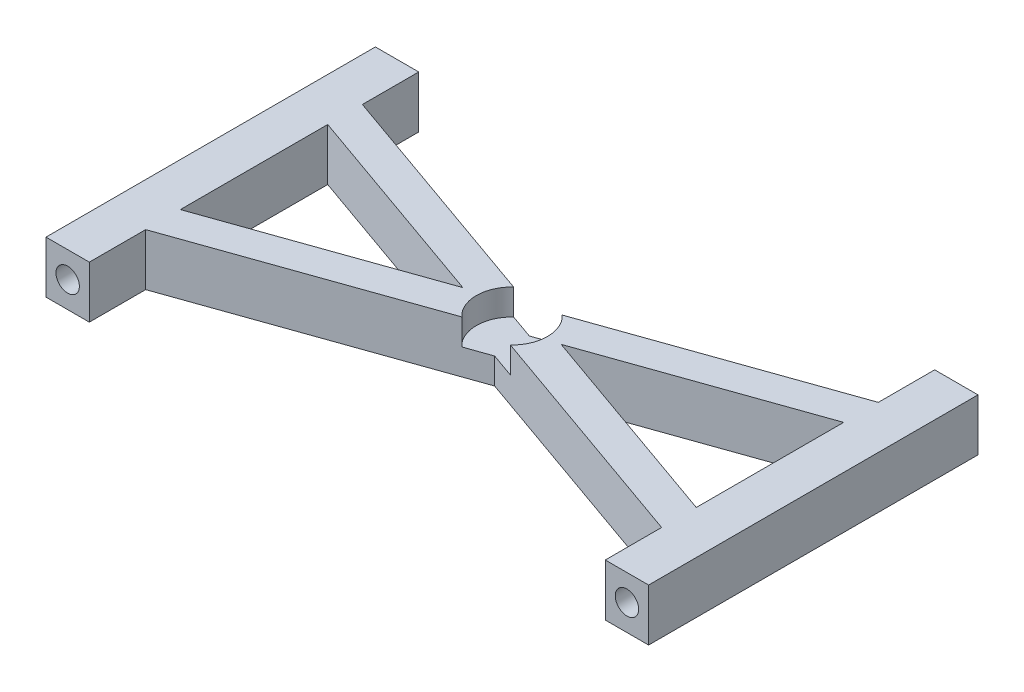
ISO-10303-21;
HEADER;
FILE_DESCRIPTION(('STEP AP214'),'2;1');
FILE_NAME('part.step','',(''),(''),'','','');
FILE_SCHEMA(('AUTOMOTIVE_DESIGN { 1 0 10303 214 1 1 1 1 }'));
ENDSEC;
DATA;
#1=APPLICATION_CONTEXT('core data for automotive mechanical design processes');
#2=APPLICATION_PROTOCOL_DEFINITION('international standard','automotive_design',2000,#1);
#3=PRODUCT_CONTEXT('',#1,'mechanical');
#4=PRODUCT('Part','Part','',(#3));
#5=PRODUCT_RELATED_PRODUCT_CATEGORY('part','',(#4));
#6=PRODUCT_DEFINITION_FORMATION('','',#4);
#7=PRODUCT_DEFINITION_CONTEXT('part definition',#1,'design');
#8=PRODUCT_DEFINITION('design','',#6,#7);
#9=PRODUCT_DEFINITION_SHAPE('','',#8);
#10=(LENGTH_UNIT() NAMED_UNIT(*) SI_UNIT(.MILLI.,.METRE.));
#11=(NAMED_UNIT(*) PLANE_ANGLE_UNIT() SI_UNIT($,.RADIAN.));
#12=(NAMED_UNIT(*) SI_UNIT($,.STERADIAN.) SOLID_ANGLE_UNIT());
#13=UNCERTAINTY_MEASURE_WITH_UNIT(LENGTH_MEASURE(1.E-05),#10,'distance_accuracy_value','');
#14=(GEOMETRIC_REPRESENTATION_CONTEXT(3) GLOBAL_UNCERTAINTY_ASSIGNED_CONTEXT((#13)) GLOBAL_UNIT_ASSIGNED_CONTEXT((#10,
#11,#12)) REPRESENTATION_CONTEXT('',''));
#15=CARTESIAN_POINT('',(0.,0.,0.));
#16=DIRECTION('',(0.,0.,1.));
#17=DIRECTION('',(1.,0.,0.));
#18=AXIS2_PLACEMENT_3D('',#15,#16,#17);
#19=CARTESIAN_POINT('',(0.,6.,0.));
#20=DIRECTION('',(0.,1.,0.));
#21=DIRECTION('',(0.,0.,1.));
#22=AXIS2_PLACEMENT_3D('',#19,#20,#21);
#23=PLANE('',#22);
#24=CARTESIAN_POINT('',(32.26,6.,-12.5));
#25=DIRECTION('',(0.,1.,0.));
#26=DIRECTION('',(0.,0.,1.));
#27=AXIS2_PLACEMENT_3D('',#24,#25,#26);
#28=CIRCLE('',#27,4.1);
#29=CARTESIAN_POINT('',(35.065500531111,6.,-9.51015606261203));
#30=VERTEX_POINT('',#29);
#31=CARTESIAN_POINT('',(35.065500531111,6.,-15.489843937388));
#32=VERTEX_POINT('',#31);
#33=EDGE_CURVE('E481',#30,#32,#28,.T.);
#34=ORIENTED_EDGE('',*,*,#33,.F.);
#35=DIRECTION('',(-0.943025428540768,0.,-0.332720665311763));
#36=VECTOR('',#35,1.);
#37=CARTESIAN_POINT('',(6.86580261060364,6.,-19.4596462563394));
#38=LINE('',#37,#36);
#39=CARTESIAN_POINT('',(62.02,6.,0.));
#40=VERTEX_POINT('',#39);
#41=EDGE_CURVE('E263',#40,#30,#38,.T.);
#42=ORIENTED_EDGE('',*,*,#41,.F.);
#43=DIRECTION('',(0.,0.,1.));
#44=VECTOR('',#43,1.);
#45=CARTESIAN_POINT('',(62.02,6.,0.));
#46=LINE('',#45,#44);
#47=CARTESIAN_POINT('',(62.02,6.,6.5));
#48=VERTEX_POINT('',#47);
#49=EDGE_CURVE('E451',#40,#48,#46,.T.);
#50=ORIENTED_EDGE('',*,*,#49,.T.);
#51=DIRECTION('',(-1.,0.,0.));
#52=VECTOR('',#51,1.);
#53=CARTESIAN_POINT('',(0.,6.,6.5));
#54=LINE('',#53,#52);
#55=CARTESIAN_POINT('',(67.02,6.,6.5));
#56=VERTEX_POINT('',#55);
#57=EDGE_CURVE('E448',#56,#48,#54,.T.);
#58=ORIENTED_EDGE('',*,*,#57,.F.);
#59=DIRECTION('',(0.,0.,1.));
#60=VECTOR('',#59,1.);
#61=CARTESIAN_POINT('',(67.02,6.,0.));
#62=LINE('',#61,#60);
#63=CARTESIAN_POINT('',(67.02,6.,-31.5));
#64=VERTEX_POINT('',#63);
#65=EDGE_CURVE('E445',#64,#56,#62,.T.);
#66=ORIENTED_EDGE('',*,*,#65,.F.);
#67=DIRECTION('',(-1.,0.,0.));
#68=VECTOR('',#67,1.);
#69=CARTESIAN_POINT('',(0.,6.,-31.5));
#70=LINE('',#69,#68);
#71=CARTESIAN_POINT('',(62.02,6.,-31.5));
#72=VERTEX_POINT('',#71);
#73=EDGE_CURVE('E443',#64,#72,#70,.T.);
#74=ORIENTED_EDGE('',*,*,#73,.T.);
#75=CARTESIAN_POINT('',(62.02,6.,-25.));
#76=VERTEX_POINT('',#75);
#77=EDGE_CURVE('E442',#72,#76,#46,.T.);
#78=ORIENTED_EDGE('',*,*,#77,.T.);
#79=DIRECTION('',(-0.943025428540768,0.,0.332720665311763));
#80=VECTOR('',#79,1.);
#81=CARTESIAN_POINT('',(-0.978298589146223,6.,-2.77277771552301));
#82=LINE('',#81,#80);
#83=EDGE_CURVE('E439',#76,#32,#82,.T.);
#84=ORIENTED_EDGE('',*,*,#83,.T.);
#85=EDGE_LOOP('',(#34,#42,#50,#58,#66,#74,#78,#84));
#86=FACE_BOUND('',#85,.T.);
#87=DIRECTION('',(0.,0.,1.));
#88=VECTOR('',#87,1.);
#89=CARTESIAN_POINT('',(62.02,6.,0.));
#90=LINE('',#89,#88);
#91=CARTESIAN_POINT('',(62.02,6.,-21.));
#92=VERTEX_POINT('',#91);
#93=CARTESIAN_POINT('',(62.02,6.,-3.99999999999999));
#94=VERTEX_POINT('',#93);
#95=EDGE_CURVE('E190',#92,#94,#90,.T.);
#96=ORIENTED_EDGE('',*,*,#95,.T.);
#97=DIRECTION('',(0.943025428540768,0.,0.332720665311763));
#98=VECTOR('',#97,1.);
#99=CARTESIAN_POINT('',(8.12085880256361,6.,-23.0168340918374));
#100=LINE('',#99,#98);
#101=CARTESIAN_POINT('',(37.9285714285714,6.,-12.5));
#102=VERTEX_POINT('',#101);
#103=EDGE_CURVE('E193',#102,#94,#100,.T.);
#104=ORIENTED_EDGE('',*,*,#103,.F.);
#105=DIRECTION('',(0.943025428540768,0.,-0.332720665311763));
#106=VECTOR('',#105,1.);
#107=CARTESIAN_POINT('',(0.276757602813755,6.,0.784410119974986));
#108=LINE('',#107,#106);
#109=EDGE_CURVE('E67',#102,#92,#108,.T.);
#110=ORIENTED_EDGE('',*,*,#109,.T.);
#111=EDGE_LOOP('',(#96,#104,#110));
#112=FACE_BOUND('',#111,.T.);
#113=ADVANCED_FACE('F43',(#86,#112),#23,.T.);
#114=CARTESIAN_POINT('',(62.02,6.,0.));
#115=DIRECTION('',(1.,0.,0.));
#116=DIRECTION('',(0.,0.,-1.));
#117=AXIS2_PLACEMENT_3D('',#114,#115,#116);
#118=PLANE('',#117);
#119=DIRECTION('',(0.,0.,1.));
#120=VECTOR('',#119,1.);
#121=CARTESIAN_POINT('',(62.02,0.,0.));
#122=LINE('',#121,#120);
#123=CARTESIAN_POINT('',(62.02,0.,-21.));
#124=VERTEX_POINT('',#123);
#125=CARTESIAN_POINT('',(62.02,0.,-3.99999999999999));
#126=VERTEX_POINT('',#125);
#127=EDGE_CURVE('E201',#124,#126,#122,.T.);
#128=ORIENTED_EDGE('',*,*,#127,.T.);
#129=DIRECTION('',(0.,-1.,0.));
#130=VECTOR('',#129,1.);
#131=CARTESIAN_POINT('',(62.02,6.,-3.99999999999999));
#132=LINE('',#131,#130);
#133=EDGE_CURVE('E198',#94,#126,#132,.T.);
#134=ORIENTED_EDGE('',*,*,#133,.F.);
#135=ORIENTED_EDGE('',*,*,#95,.F.);
#136=DIRECTION('',(0.,-1.,0.));
#137=VECTOR('',#136,1.);
#138=CARTESIAN_POINT('',(62.02,6.,-21.));
#139=LINE('',#138,#137);
#140=EDGE_CURVE('E264',#92,#124,#139,.T.);
#141=ORIENTED_EDGE('',*,*,#140,.T.);
#142=EDGE_LOOP('',(#128,#134,#135,#141));
#143=FACE_BOUND('',#142,.T.);
#144=ADVANCED_FACE('F199',(#143),#118,.F.);
#145=CARTESIAN_POINT('',(8.12085880256361,6.,-23.0168340918374));
#146=DIRECTION('',(0.332720665311763,0.,-0.943025428540767));
#147=DIRECTION('',(-0.943025428540768,0.,-0.332720665311763));
#148=AXIS2_PLACEMENT_3D('',#145,#146,#147);
#149=PLANE('',#148);
#150=DIRECTION('',(0.943025428540768,0.,0.332720665311763));
#151=VECTOR('',#150,1.);
#152=CARTESIAN_POINT('',(8.12085880256361,0.,-23.0168340918374));
#153=LINE('',#152,#151);
#154=CARTESIAN_POINT('',(37.9285714285714,0.,-12.5));
#155=VERTEX_POINT('',#154);
#156=EDGE_CURVE('E260',#155,#126,#153,.T.);
#157=ORIENTED_EDGE('',*,*,#156,.F.);
#158=DIRECTION('',(0.,-1.,0.));
#159=VECTOR('',#158,1.);
#160=CARTESIAN_POINT('',(37.9285714285714,6.,-12.5));
#161=LINE('',#160,#159);
#162=EDGE_CURVE('E205',#102,#155,#161,.T.);
#163=ORIENTED_EDGE('',*,*,#162,.F.);
#164=ORIENTED_EDGE('',*,*,#103,.T.);
#165=ORIENTED_EDGE('',*,*,#133,.T.);
#166=EDGE_LOOP('',(#157,#163,#164,#165));
#167=FACE_BOUND('',#166,.T.);
#168=ADVANCED_FACE('F207',(#167),#149,.T.);
#169=CARTESIAN_POINT('',(6.86580261060364,6.,-19.4596462563394));
#170=DIRECTION('',(-0.332720665311763,0.,0.943025428540767));
#171=DIRECTION('',(0.943025428540768,0.,0.332720665311763));
#172=AXIS2_PLACEMENT_3D('',#169,#170,#171);
#173=PLANE('',#172);
#174=DIRECTION('',(-0.943025428540768,0.,-0.332720665311763));
#175=VECTOR('',#174,1.);
#176=CARTESIAN_POINT('',(6.86580261060364,0.,-19.4596462563394));
#177=LINE('',#176,#175);
#178=CARTESIAN_POINT('',(26.5914285714286,0.,-12.5));
#179=VERTEX_POINT('',#178);
#180=CARTESIAN_POINT('',(2.5,0.,-21.));
#181=VERTEX_POINT('',#180);
#182=EDGE_CURVE('E250',#179,#181,#177,.T.);
#183=ORIENTED_EDGE('',*,*,#182,.F.);
#184=DIRECTION('',(0.,-1.,0.));
#185=VECTOR('',#184,1.);
#186=CARTESIAN_POINT('',(26.5914285714286,6.,-12.5));
#187=LINE('',#186,#185);
#188=CARTESIAN_POINT('',(26.5914285714286,6.,-12.5));
#189=VERTEX_POINT('',#188);
#190=EDGE_CURVE('E266',#189,#179,#187,.T.);
#191=ORIENTED_EDGE('',*,*,#190,.F.);
#192=DIRECTION('',(-0.943025428540768,0.,-0.332720665311763));
#193=VECTOR('',#192,1.);
#194=CARTESIAN_POINT('',(6.86580261060364,6.,-19.4596462563394));
#195=LINE('',#194,#193);
#196=CARTESIAN_POINT('',(2.5,6.,-21.));
#197=VERTEX_POINT('',#196);
#198=EDGE_CURVE('E328',#189,#197,#195,.T.);
#199=ORIENTED_EDGE('',*,*,#198,.T.);
#200=DIRECTION('',(0.,-1.,0.));
#201=VECTOR('',#200,1.);
#202=CARTESIAN_POINT('',(2.5,6.,-21.));
#203=LINE('',#202,#201);
#204=EDGE_CURVE('E268',#197,#181,#203,.T.);
#205=ORIENTED_EDGE('',*,*,#204,.T.);
#206=EDGE_LOOP('',(#183,#191,#199,#205));
#207=FACE_BOUND('',#206,.T.);
#208=ADVANCED_FACE('F355',(#207),#173,.T.);
#209=CARTESIAN_POINT('',(-0.978298589146223,6.,-2.77277771552301));
#210=DIRECTION('',(0.332720665311763,0.,0.943025428540767));
#211=DIRECTION('',(0.943025428540768,0.,-0.332720665311763));
#212=AXIS2_PLACEMENT_3D('',#209,#210,#211);
#213=PLANE('',#212);
#214=DIRECTION('',(-0.943025428540768,0.,0.332720665311763));
#215=VECTOR('',#214,1.);
#216=CARTESIAN_POINT('',(-0.978298589146223,0.,-2.77277771552301));
#217=LINE('',#216,#215);
#218=CARTESIAN_POINT('',(2.5,0.,-4.));
#219=VERTEX_POINT('',#218);
#220=EDGE_CURVE('E253',#179,#219,#217,.T.);
#221=ORIENTED_EDGE('',*,*,#220,.T.);
#222=DIRECTION('',(0.,-1.,0.));
#223=VECTOR('',#222,1.);
#224=CARTESIAN_POINT('',(2.5,6.,-4.));
#225=LINE('',#224,#223);
#226=CARTESIAN_POINT('',(2.5,6.,-4.));
#227=VERTEX_POINT('',#226);
#228=EDGE_CURVE('E270',#227,#219,#225,.T.);
#229=ORIENTED_EDGE('',*,*,#228,.F.);
#230=DIRECTION('',(-0.943025428540768,0.,0.332720665311763));
#231=VECTOR('',#230,1.);
#232=CARTESIAN_POINT('',(-0.978298589146223,6.,-2.77277771552301));
#233=LINE('',#232,#231);
#234=EDGE_CURVE('E331',#189,#227,#233,.T.);
#235=ORIENTED_EDGE('',*,*,#234,.F.);
#236=ORIENTED_EDGE('',*,*,#190,.T.);
#237=EDGE_LOOP('',(#221,#229,#235,#236));
#238=FACE_BOUND('',#237,.T.);
#239=ADVANCED_FACE('F348',(#238),#213,.F.);
#240=CARTESIAN_POINT('',(6.86580261060364,6.,-19.4596462563394));
#241=DIRECTION('',(-0.332720665311763,0.,0.943025428540767));
#242=DIRECTION('',(0.943025428540768,0.,0.332720665311763));
#243=AXIS2_PLACEMENT_3D('',#240,#241,#242);
#244=PLANE('',#243);
#245=DIRECTION('',(0.,1.,0.));
#246=VECTOR('',#245,1.);
#247=CARTESIAN_POINT('',(35.065500531111,3.,-9.51015606261203));
#248=LINE('',#247,#246);
#249=CARTESIAN_POINT('',(35.065500531111,3.,-9.51015606261203));
#250=VERTEX_POINT('',#249);
#251=EDGE_CURVE('E474',#250,#30,#248,.T.);
#252=ORIENTED_EDGE('',*,*,#251,.F.);
#253=DIRECTION('',(-0.943025428540768,0.,-0.332720665311763));
#254=VECTOR('',#253,1.);
#255=CARTESIAN_POINT('',(6.86580261060364,3.,-19.4596462563394));
#256=LINE('',#255,#254);
#257=CARTESIAN_POINT('',(32.26,3.,-10.5));
#258=VERTEX_POINT('',#257);
#259=EDGE_CURVE('E471',#250,#258,#256,.T.);
#260=ORIENTED_EDGE('',*,*,#259,.T.);
#261=DIRECTION('',(0.,-1.,0.));
#262=VECTOR('',#261,1.);
#263=CARTESIAN_POINT('',(32.26,6.,-10.5));
#264=LINE('',#263,#262);
#265=CARTESIAN_POINT('',(32.26,0.,-10.5));
#266=VERTEX_POINT('',#265);
#267=EDGE_CURVE('E209',#258,#266,#264,.T.);
#268=ORIENTED_EDGE('',*,*,#267,.T.);
#269=DIRECTION('',(-0.943025428540768,0.,-0.332720665311763));
#270=VECTOR('',#269,1.);
#271=CARTESIAN_POINT('',(6.86580261060364,0.,-19.4596462563394));
#272=LINE('',#271,#270);
#273=CARTESIAN_POINT('',(62.02,0.,0.));
#274=VERTEX_POINT('',#273);
#275=EDGE_CURVE('E213',#274,#266,#272,.T.);
#276=ORIENTED_EDGE('',*,*,#275,.F.);
#277=DIRECTION('',(0.,-1.,0.));
#278=VECTOR('',#277,1.);
#279=CARTESIAN_POINT('',(62.02,6.,0.));
#280=LINE('',#279,#278);
#281=EDGE_CURVE('E144',#40,#274,#280,.T.);
#282=ORIENTED_EDGE('',*,*,#281,.F.);
#283=ORIENTED_EDGE('',*,*,#41,.T.);
#284=EDGE_LOOP('',(#252,#260,#268,#276,#282,#283));
#285=FACE_BOUND('',#284,.T.);
#286=ADVANCED_FACE('F45',(#285),#244,.T.);
#287=CARTESIAN_POINT('',(62.02,6.,0.));
#288=DIRECTION('',(1.,0.,0.));
#289=DIRECTION('',(0.,0.,-1.));
#290=AXIS2_PLACEMENT_3D('',#287,#288,#289);
#291=PLANE('',#290);
#292=DIRECTION('',(0.,0.,1.));
#293=VECTOR('',#292,1.);
#294=CARTESIAN_POINT('',(62.02,0.,0.));
#295=LINE('',#294,#293);
#296=CARTESIAN_POINT('',(62.02,0.,6.5));
#297=VERTEX_POINT('',#296);
#298=EDGE_CURVE('E216',#274,#297,#295,.T.);
#299=ORIENTED_EDGE('',*,*,#298,.T.);
#300=DIRECTION('',(0.,-1.,0.));
#301=VECTOR('',#300,1.);
#302=CARTESIAN_POINT('',(62.02,6.,6.5));
#303=LINE('',#302,#301);
#304=EDGE_CURVE('E299',#48,#297,#303,.T.);
#305=ORIENTED_EDGE('',*,*,#304,.F.);
#306=ORIENTED_EDGE('',*,*,#49,.F.);
#307=ORIENTED_EDGE('',*,*,#281,.T.);
#308=EDGE_LOOP('',(#299,#305,#306,#307));
#309=FACE_BOUND('',#308,.T.);
#310=ADVANCED_FACE('F537',(#309),#291,.F.);
#311=CARTESIAN_POINT('',(0.,6.,6.5));
#312=DIRECTION('',(0.,0.,1.));
#313=DIRECTION('',(1.,0.,0.));
#314=AXIS2_PLACEMENT_3D('',#311,#312,#313);
#315=PLANE('',#314);
#316=CARTESIAN_POINT('',(64.52,3.,6.5));
#317=DIRECTION('',(0.,0.,1.));
#318=DIRECTION('',(1.,0.,0.));
#319=AXIS2_PLACEMENT_3D('',#316,#317,#318);
#320=CIRCLE('',#319,1.35000000000001);
#321=CARTESIAN_POINT('',(65.87,3.,6.5));
#322=VERTEX_POINT('',#321);
#323=EDGE_CURVE('E454',#322,#322,#320,.T.);
#324=ORIENTED_EDGE('',*,*,#323,.F.);
#325=EDGE_LOOP('',(#324));
#326=FACE_BOUND('',#325,.T.);
#327=DIRECTION('',(-1.,0.,0.));
#328=VECTOR('',#327,1.);
#329=CARTESIAN_POINT('',(0.,0.,6.5));
#330=LINE('',#329,#328);
#331=CARTESIAN_POINT('',(67.02,0.,6.5));
#332=VERTEX_POINT('',#331);
#333=EDGE_CURVE('E220',#332,#297,#330,.T.);
#334=ORIENTED_EDGE('',*,*,#333,.F.);
#335=DIRECTION('',(0.,-1.,0.));
#336=VECTOR('',#335,1.);
#337=CARTESIAN_POINT('',(67.02,6.,6.5));
#338=LINE('',#337,#336);
#339=EDGE_CURVE('E297',#56,#332,#338,.T.);
#340=ORIENTED_EDGE('',*,*,#339,.F.);
#341=ORIENTED_EDGE('',*,*,#57,.T.);
#342=ORIENTED_EDGE('',*,*,#304,.T.);
#343=EDGE_LOOP('',(#334,#340,#341,#342));
#344=FACE_BOUND('',#343,.T.);
#345=ADVANCED_FACE('F518',(#326,#344),#315,.T.);
#346=CARTESIAN_POINT('',(67.02,6.,0.));
#347=DIRECTION('',(1.,0.,0.));
#348=DIRECTION('',(0.,0.,-1.));
#349=AXIS2_PLACEMENT_3D('',#346,#347,#348);
#350=PLANE('',#349);
#351=DIRECTION('',(0.,0.,1.));
#352=VECTOR('',#351,1.);
#353=CARTESIAN_POINT('',(67.02,0.,0.));
#354=LINE('',#353,#352);
#355=CARTESIAN_POINT('',(67.02,0.,-31.5));
#356=VERTEX_POINT('',#355);
#357=EDGE_CURVE('E224',#356,#332,#354,.T.);
#358=ORIENTED_EDGE('',*,*,#357,.F.);
#359=DIRECTION('',(0.,-1.,0.));
#360=VECTOR('',#359,1.);
#361=CARTESIAN_POINT('',(67.02,6.,-31.5));
#362=LINE('',#361,#360);
#363=EDGE_CURVE('E295',#64,#356,#362,.T.);
#364=ORIENTED_EDGE('',*,*,#363,.F.);
#365=ORIENTED_EDGE('',*,*,#65,.T.);
#366=ORIENTED_EDGE('',*,*,#339,.T.);
#367=EDGE_LOOP('',(#358,#364,#365,#366));
#368=FACE_BOUND('',#367,.T.);
#369=ADVANCED_FACE('F514',(#368),#350,.T.);
#370=CARTESIAN_POINT('',(0.,6.,-31.5));
#371=DIRECTION('',(0.,0.,1.));
#372=DIRECTION('',(1.,0.,0.));
#373=AXIS2_PLACEMENT_3D('',#370,#371,#372);
#374=PLANE('',#373);
#375=CARTESIAN_POINT('',(64.52,3.,-31.5));
#376=DIRECTION('',(0.,0.,1.));
#377=DIRECTION('',(1.,0.,0.));
#378=AXIS2_PLACEMENT_3D('',#375,#376,#377);
#379=CIRCLE('',#378,1.35000000000001);
#380=CARTESIAN_POINT('',(65.87,3.,-31.5));
#381=VERTEX_POINT('',#380);
#382=EDGE_CURVE('E457',#381,#381,#379,.T.);
#383=ORIENTED_EDGE('',*,*,#382,.T.);
#384=EDGE_LOOP('',(#383));
#385=FACE_BOUND('',#384,.T.);
#386=DIRECTION('',(-1.,0.,0.));
#387=VECTOR('',#386,1.);
#388=CARTESIAN_POINT('',(0.,0.,-31.5));
#389=LINE('',#388,#387);
#390=CARTESIAN_POINT('',(62.02,0.,-31.5));
#391=VERTEX_POINT('',#390);
#392=EDGE_CURVE('E227',#356,#391,#389,.T.);
#393=ORIENTED_EDGE('',*,*,#392,.T.);
#394=DIRECTION('',(0.,-1.,0.));
#395=VECTOR('',#394,1.);
#396=CARTESIAN_POINT('',(62.02,6.,-31.5));
#397=LINE('',#396,#395);
#398=EDGE_CURVE('E292',#72,#391,#397,.T.);
#399=ORIENTED_EDGE('',*,*,#398,.F.);
#400=ORIENTED_EDGE('',*,*,#73,.F.);
#401=ORIENTED_EDGE('',*,*,#363,.T.);
#402=EDGE_LOOP('',(#393,#399,#400,#401));
#403=FACE_BOUND('',#402,.T.);
#404=ADVANCED_FACE('F510',(#385,#403),#374,.F.);
#405=CARTESIAN_POINT('',(62.02,0.,-25.));
#406=VERTEX_POINT('',#405);
#407=EDGE_CURVE('E221',#391,#406,#295,.T.);
#408=ORIENTED_EDGE('',*,*,#407,.T.);
#409=DIRECTION('',(0.,-1.,0.));
#410=VECTOR('',#409,1.);
#411=CARTESIAN_POINT('',(62.02,6.,-25.));
#412=LINE('',#411,#410);
#413=EDGE_CURVE('E289',#76,#406,#412,.T.);
#414=ORIENTED_EDGE('',*,*,#413,.F.);
#415=ORIENTED_EDGE('',*,*,#77,.F.);
#416=ORIENTED_EDGE('',*,*,#398,.T.);
#417=EDGE_LOOP('',(#408,#414,#415,#416));
#418=FACE_BOUND('',#417,.T.);
#419=ADVANCED_FACE('F506',(#418),#291,.F.);
#420=CARTESIAN_POINT('',(-0.978298589146223,6.,-2.77277771552301));
#421=DIRECTION('',(0.332720665311763,0.,0.943025428540767));
#422=DIRECTION('',(0.943025428540768,0.,-0.332720665311763));
#423=AXIS2_PLACEMENT_3D('',#420,#421,#422);
#424=PLANE('',#423);
#425=DIRECTION('',(-0.943025428540768,0.,0.332720665311763));
#426=VECTOR('',#425,1.);
#427=CARTESIAN_POINT('',(-0.978298589146223,3.,-2.77277771552301));
#428=LINE('',#427,#426);
#429=CARTESIAN_POINT('',(35.065500531111,3.,-15.489843937388));
#430=VERTEX_POINT('',#429);
#431=CARTESIAN_POINT('',(32.26,3.,-14.5));
#432=VERTEX_POINT('',#431);
#433=EDGE_CURVE('E458',#430,#432,#428,.T.);
#434=ORIENTED_EDGE('',*,*,#433,.F.);
#435=DIRECTION('',(0.,1.,0.));
#436=VECTOR('',#435,1.);
#437=CARTESIAN_POINT('',(35.065500531111,3.,-15.489843937388));
#438=LINE('',#437,#436);
#439=EDGE_CURVE('E477',#430,#32,#438,.T.);
#440=ORIENTED_EDGE('',*,*,#439,.T.);
#441=ORIENTED_EDGE('',*,*,#83,.F.);
#442=ORIENTED_EDGE('',*,*,#413,.T.);
#443=DIRECTION('',(-0.943025428540768,0.,0.332720665311763));
#444=VECTOR('',#443,1.);
#445=CARTESIAN_POINT('',(-0.978298589146223,0.,-2.77277771552301));
#446=LINE('',#445,#444);
#447=CARTESIAN_POINT('',(32.26,0.,-14.5));
#448=VERTEX_POINT('',#447);
#449=EDGE_CURVE('E229',#406,#448,#446,.T.);
#450=ORIENTED_EDGE('',*,*,#449,.T.);
#451=DIRECTION('',(0.,-1.,0.));
#452=VECTOR('',#451,1.);
#453=CARTESIAN_POINT('',(32.26,6.,-14.5));
#454=LINE('',#453,#452);
#455=EDGE_CURVE('E287',#432,#448,#454,.T.);
#456=ORIENTED_EDGE('',*,*,#455,.F.);
#457=EDGE_LOOP('',(#434,#440,#441,#442,#450,#456));
#458=FACE_BOUND('',#457,.T.);
#459=ADVANCED_FACE('F419',(#458),#424,.F.);
#460=CARTESIAN_POINT('',(8.12085880256361,6.,-23.0168340918374));
#461=DIRECTION('',(0.332720665311763,0.,-0.943025428540767));
#462=DIRECTION('',(-0.943025428540768,0.,-0.332720665311763));
#463=AXIS2_PLACEMENT_3D('',#460,#461,#462);
#464=PLANE('',#463);
#465=DIRECTION('',(0.,1.,0.));
#466=VECTOR('',#465,1.);
#467=CARTESIAN_POINT('',(29.4544994688889,3.,-15.489843937388));
#468=LINE('',#467,#466);
#469=CARTESIAN_POINT('',(29.4544994688889,3.,-15.489843937388));
#470=VERTEX_POINT('',#469);
#471=CARTESIAN_POINT('',(29.4544994688889,6.,-15.489843937388));
#472=VERTEX_POINT('',#471);
#473=EDGE_CURVE('E58',#470,#472,#468,.T.);
#474=ORIENTED_EDGE('',*,*,#473,.F.);
#475=DIRECTION('',(0.943025428540768,0.,0.332720665311763));
#476=VECTOR('',#475,1.);
#477=CARTESIAN_POINT('',(8.12085880256361,3.,-23.0168340918374));
#478=LINE('',#477,#476);
#479=EDGE_CURVE('E468',#470,#432,#478,.T.);
#480=ORIENTED_EDGE('',*,*,#479,.T.);
#481=ORIENTED_EDGE('',*,*,#455,.T.);
#482=DIRECTION('',(0.943025428540768,0.,0.332720665311763));
#483=VECTOR('',#482,1.);
#484=CARTESIAN_POINT('',(8.12085880256361,0.,-23.0168340918374));
#485=LINE('',#484,#483);
#486=CARTESIAN_POINT('',(2.5,0.,-25.));
#487=VERTEX_POINT('',#486);
#488=EDGE_CURVE('E232',#487,#448,#485,.T.);
#489=ORIENTED_EDGE('',*,*,#488,.F.);
#490=DIRECTION('',(0.,-1.,0.));
#491=VECTOR('',#490,1.);
#492=CARTESIAN_POINT('',(2.5,6.,-25.));
#493=LINE('',#492,#491);
#494=CARTESIAN_POINT('',(2.5,6.,-25.));
#495=VERTEX_POINT('',#494);
#496=EDGE_CURVE('E285',#495,#487,#493,.T.);
#497=ORIENTED_EDGE('',*,*,#496,.F.);
#498=DIRECTION('',(0.943025428540768,0.,0.332720665311763));
#499=VECTOR('',#498,1.);
#500=CARTESIAN_POINT('',(8.12085880256361,6.,-23.0168340918374));
#501=LINE('',#500,#499);
#502=EDGE_CURVE('E436',#495,#472,#501,.T.);
#503=ORIENTED_EDGE('',*,*,#502,.T.);
#504=EDGE_LOOP('',(#474,#480,#481,#489,#497,#503));
#505=FACE_BOUND('',#504,.T.);
#506=ADVANCED_FACE('F410',(#505),#464,.T.);
#507=CARTESIAN_POINT('',(2.5,6.,0.));
#508=DIRECTION('',(1.,0.,0.));
#509=DIRECTION('',(0.,0.,-1.));
#510=AXIS2_PLACEMENT_3D('',#507,#508,#509);
#511=PLANE('',#510);
#512=DIRECTION('',(0.,0.,1.));
#513=VECTOR('',#512,1.);
#514=CARTESIAN_POINT('',(2.5,0.,0.));
#515=LINE('',#514,#513);
#516=CARTESIAN_POINT('',(2.5,0.,-31.5));
#517=VERTEX_POINT('',#516);
#518=EDGE_CURVE('E235',#517,#487,#515,.T.);
#519=ORIENTED_EDGE('',*,*,#518,.F.);
#520=DIRECTION('',(0.,-1.,0.));
#521=VECTOR('',#520,1.);
#522=CARTESIAN_POINT('',(2.5,6.,-31.5));
#523=LINE('',#522,#521);
#524=CARTESIAN_POINT('',(2.5,6.,-31.5));
#525=VERTEX_POINT('',#524);
#526=EDGE_CURVE('E283',#525,#517,#523,.T.);
#527=ORIENTED_EDGE('',*,*,#526,.F.);
#528=DIRECTION('',(0.,0.,1.));
#529=VECTOR('',#528,1.);
#530=CARTESIAN_POINT('',(2.5,6.,0.));
#531=LINE('',#530,#529);
#532=EDGE_CURVE('E335',#525,#495,#531,.T.);
#533=ORIENTED_EDGE('',*,*,#532,.T.);
#534=ORIENTED_EDGE('',*,*,#496,.T.);
#535=EDGE_LOOP('',(#519,#527,#533,#534));
#536=FACE_BOUND('',#535,.T.);
#537=ADVANCED_FACE('F399',(#536),#511,.T.);
#538=CARTESIAN_POINT('',(0.,6.,-31.5));
#539=DIRECTION('',(0.,0.,-1.));
#540=DIRECTION('',(-1.,0.,0.));
#541=AXIS2_PLACEMENT_3D('',#538,#539,#540);
#542=PLANE('',#541);
#543=CARTESIAN_POINT('',(0.,3.,-31.5));
#544=DIRECTION('',(0.,0.,-1.));
#545=DIRECTION('',(-1.,0.,0.));
#546=AXIS2_PLACEMENT_3D('',#543,#544,#545);
#547=CIRCLE('',#546,1.35);
#548=CARTESIAN_POINT('',(-1.35,3.,-31.5));
#549=VERTEX_POINT('',#548);
#550=EDGE_CURVE('E461',#549,#549,#547,.T.);
#551=ORIENTED_EDGE('',*,*,#550,.F.);
#552=EDGE_LOOP('',(#551));
#553=FACE_BOUND('',#552,.T.);
#554=DIRECTION('',(1.,0.,0.));
#555=VECTOR('',#554,1.);
#556=CARTESIAN_POINT('',(0.,0.,-31.5));
#557=LINE('',#556,#555);
#558=CARTESIAN_POINT('',(-2.5,0.,-31.5));
#559=VERTEX_POINT('',#558);
#560=EDGE_CURVE('E238',#559,#517,#557,.T.);
#561=ORIENTED_EDGE('',*,*,#560,.F.);
#562=DIRECTION('',(0.,-1.,0.));
#563=VECTOR('',#562,1.);
#564=CARTESIAN_POINT('',(-2.5,6.,-31.5));
#565=LINE('',#564,#563);
#566=CARTESIAN_POINT('',(-2.5,6.,-31.5));
#567=VERTEX_POINT('',#566);
#568=EDGE_CURVE('E281',#567,#559,#565,.T.);
#569=ORIENTED_EDGE('',*,*,#568,.F.);
#570=DIRECTION('',(1.,0.,0.));
#571=VECTOR('',#570,1.);
#572=CARTESIAN_POINT('',(0.,6.,-31.5));
#573=LINE('',#572,#571);
#574=EDGE_CURVE('E433',#567,#525,#573,.T.);
#575=ORIENTED_EDGE('',*,*,#574,.T.);
#576=ORIENTED_EDGE('',*,*,#526,.T.);
#577=EDGE_LOOP('',(#561,#569,#575,#576));
#578=FACE_BOUND('',#577,.T.);
#579=ADVANCED_FACE('F409',(#553,#578),#542,.T.);
#580=CARTESIAN_POINT('',(-2.5,6.,0.));
#581=DIRECTION('',(1.,0.,0.));
#582=DIRECTION('',(0.,0.,-1.));
#583=AXIS2_PLACEMENT_3D('',#580,#581,#582);
#584=PLANE('',#583);
#585=DIRECTION('',(0.,0.,1.));
#586=VECTOR('',#585,1.);
#587=CARTESIAN_POINT('',(-2.5,0.,0.));
#588=LINE('',#587,#586);
#589=CARTESIAN_POINT('',(-2.5,0.,6.5));
#590=VERTEX_POINT('',#589);
#591=EDGE_CURVE('E242',#559,#590,#588,.T.);
#592=ORIENTED_EDGE('',*,*,#591,.T.);
#593=DIRECTION('',(0.,-1.,0.));
#594=VECTOR('',#593,1.);
#595=CARTESIAN_POINT('',(-2.5,6.,6.5));
#596=LINE('',#595,#594);
#597=CARTESIAN_POINT('',(-2.5,6.,6.5));
#598=VERTEX_POINT('',#597);
#599=EDGE_CURVE('E278',#598,#590,#596,.T.);
#600=ORIENTED_EDGE('',*,*,#599,.F.);
#601=DIRECTION('',(0.,0.,1.));
#602=VECTOR('',#601,1.);
#603=CARTESIAN_POINT('',(-2.5,6.,0.));
#604=LINE('',#603,#602);
#605=EDGE_CURVE('E434',#567,#598,#604,.T.);
#606=ORIENTED_EDGE('',*,*,#605,.F.);
#607=ORIENTED_EDGE('',*,*,#568,.T.);
#608=EDGE_LOOP('',(#592,#600,#606,#607));
#609=FACE_BOUND('',#608,.T.);
#610=ADVANCED_FACE('F404',(#609),#584,.F.);
#611=CARTESIAN_POINT('',(0.,6.,6.5));
#612=DIRECTION('',(0.,0.,-1.));
#613=DIRECTION('',(-1.,0.,0.));
#614=AXIS2_PLACEMENT_3D('',#611,#612,#613);
#615=PLANE('',#614);
#616=CARTESIAN_POINT('',(0.,3.,6.5));
#617=DIRECTION('',(0.,0.,-1.));
#618=DIRECTION('',(-1.,0.,0.));
#619=AXIS2_PLACEMENT_3D('',#616,#617,#618);
#620=CIRCLE('',#619,1.35);
#621=CARTESIAN_POINT('',(-1.35,3.,6.5));
#622=VERTEX_POINT('',#621);
#623=EDGE_CURVE('E217',#622,#622,#620,.T.);
#624=ORIENTED_EDGE('',*,*,#623,.T.);
#625=EDGE_LOOP('',(#624));
#626=FACE_BOUND('',#625,.T.);
#627=DIRECTION('',(1.,0.,0.));
#628=VECTOR('',#627,1.);
#629=CARTESIAN_POINT('',(0.,0.,6.5));
#630=LINE('',#629,#628);
#631=CARTESIAN_POINT('',(2.5,0.,6.5));
#632=VERTEX_POINT('',#631);
#633=EDGE_CURVE('E244',#590,#632,#630,.T.);
#634=ORIENTED_EDGE('',*,*,#633,.T.);
#635=DIRECTION('',(0.,-1.,0.));
#636=VECTOR('',#635,1.);
#637=CARTESIAN_POINT('',(2.5,6.,6.5));
#638=LINE('',#637,#636);
#639=CARTESIAN_POINT('',(2.5,6.,6.5));
#640=VERTEX_POINT('',#639);
#641=EDGE_CURVE('E276',#640,#632,#638,.T.);
#642=ORIENTED_EDGE('',*,*,#641,.F.);
#643=DIRECTION('',(1.,0.,0.));
#644=VECTOR('',#643,1.);
#645=CARTESIAN_POINT('',(0.,6.,6.5));
#646=LINE('',#645,#644);
#647=EDGE_CURVE('E333',#598,#640,#646,.T.);
#648=ORIENTED_EDGE('',*,*,#647,.F.);
#649=ORIENTED_EDGE('',*,*,#599,.T.);
#650=EDGE_LOOP('',(#634,#642,#648,#649));
#651=FACE_BOUND('',#650,.T.);
#652=ADVANCED_FACE('F396',(#626,#651),#615,.F.);
#653=CARTESIAN_POINT('',(2.5,0.,0.));
#654=VERTEX_POINT('',#653);
#655=EDGE_CURVE('E239',#654,#632,#515,.T.);
#656=ORIENTED_EDGE('',*,*,#655,.F.);
#657=DIRECTION('',(0.,-1.,0.));
#658=VECTOR('',#657,1.);
#659=CARTESIAN_POINT('',(2.5,6.,0.));
#660=LINE('',#659,#658);
#661=CARTESIAN_POINT('',(2.5,6.,0.));
#662=VERTEX_POINT('',#661);
#663=EDGE_CURVE('E274',#662,#654,#660,.T.);
#664=ORIENTED_EDGE('',*,*,#663,.F.);
#665=EDGE_CURVE('E327',#662,#640,#531,.T.);
#666=ORIENTED_EDGE('',*,*,#665,.T.);
#667=ORIENTED_EDGE('',*,*,#641,.T.);
#668=EDGE_LOOP('',(#656,#664,#666,#667));
#669=FACE_BOUND('',#668,.T.);
#670=ADVANCED_FACE('F392',(#669),#511,.T.);
#671=CARTESIAN_POINT('',(2.5,6.,0.));
#672=DIRECTION('',(1.,0.,0.));
#673=DIRECTION('',(0.,0.,-1.));
#674=AXIS2_PLACEMENT_3D('',#671,#672,#673);
#675=PLANE('',#674);
#676=DIRECTION('',(0.,0.,1.));
#677=VECTOR('',#676,1.);
#678=CARTESIAN_POINT('',(2.5,0.,0.));
#679=LINE('',#678,#677);
#680=EDGE_CURVE('E256',#181,#219,#679,.T.);
#681=ORIENTED_EDGE('',*,*,#680,.F.);
#682=ORIENTED_EDGE('',*,*,#204,.F.);
#683=DIRECTION('',(0.,0.,1.));
#684=VECTOR('',#683,1.);
#685=CARTESIAN_POINT('',(2.5,6.,0.));
#686=LINE('',#685,#684);
#687=EDGE_CURVE('E195',#197,#227,#686,.T.);
#688=ORIENTED_EDGE('',*,*,#687,.T.);
#689=ORIENTED_EDGE('',*,*,#228,.T.);
#690=EDGE_LOOP('',(#681,#682,#688,#689));
#691=FACE_BOUND('',#690,.T.);
#692=ADVANCED_FACE('F343',(#691),#675,.T.);
#693=CARTESIAN_POINT('',(0.276757602813755,6.,0.784410119974986));
#694=DIRECTION('',(-0.332720665311763,0.,-0.943025428540767));
#695=DIRECTION('',(-0.943025428540768,0.,0.332720665311763));
#696=AXIS2_PLACEMENT_3D('',#693,#694,#695);
#697=PLANE('',#696);
#698=DIRECTION('',(0.943025428540768,0.,-0.332720665311763));
#699=VECTOR('',#698,1.);
#700=CARTESIAN_POINT('',(0.276757602813755,3.,0.784410119974986));
#701=LINE('',#700,#699);
#702=CARTESIAN_POINT('',(29.4544994688889,3.,-9.51015606261203));
#703=VERTEX_POINT('',#702);
#704=EDGE_CURVE('E11',#703,#258,#701,.T.);
#705=ORIENTED_EDGE('',*,*,#704,.F.);
#706=DIRECTION('',(0.,1.,0.));
#707=VECTOR('',#706,1.);
#708=CARTESIAN_POINT('',(29.4544994688889,3.,-9.51015606261203));
#709=LINE('',#708,#707);
#710=CARTESIAN_POINT('',(29.4544994688889,6.,-9.51015606261203));
#711=VERTEX_POINT('',#710);
#712=EDGE_CURVE('E306',#703,#711,#709,.T.);
#713=ORIENTED_EDGE('',*,*,#712,.T.);
#714=DIRECTION('',(0.943025428540768,0.,-0.332720665311763));
#715=VECTOR('',#714,1.);
#716=CARTESIAN_POINT('',(0.276757602813755,6.,0.784410119974986));
#717=LINE('',#716,#715);
#718=EDGE_CURVE('E319',#662,#711,#717,.T.);
#719=ORIENTED_EDGE('',*,*,#718,.F.);
#720=ORIENTED_EDGE('',*,*,#663,.T.);
#721=DIRECTION('',(0.943025428540768,0.,-0.332720665311763));
#722=VECTOR('',#721,1.);
#723=CARTESIAN_POINT('',(0.276757602813755,0.,0.784410119974986));
#724=LINE('',#723,#722);
#725=EDGE_CURVE('E247',#654,#266,#724,.T.);
#726=ORIENTED_EDGE('',*,*,#725,.T.);
#727=ORIENTED_EDGE('',*,*,#267,.F.);
#728=EDGE_LOOP('',(#705,#713,#719,#720,#726,#727));
#729=FACE_BOUND('',#728,.T.);
#730=ADVANCED_FACE('F318',(#729),#697,.F.);
#731=CARTESIAN_POINT('',(0.276757602813755,6.,0.784410119974986));
#732=DIRECTION('',(-0.332720665311763,0.,-0.943025428540767));
#733=DIRECTION('',(-0.943025428540768,0.,0.332720665311763));
#734=AXIS2_PLACEMENT_3D('',#731,#732,#733);
#735=PLANE('',#734);
#736=DIRECTION('',(0.943025428540768,0.,-0.332720665311763));
#737=VECTOR('',#736,1.);
#738=CARTESIAN_POINT('',(0.276757602813755,0.,0.784410119974986));
#739=LINE('',#738,#737);
#740=EDGE_CURVE('E136',#155,#124,#739,.T.);
#741=ORIENTED_EDGE('',*,*,#740,.T.);
#742=ORIENTED_EDGE('',*,*,#140,.F.);
#743=ORIENTED_EDGE('',*,*,#109,.F.);
#744=ORIENTED_EDGE('',*,*,#162,.T.);
#745=EDGE_LOOP('',(#741,#742,#743,#744));
#746=FACE_BOUND('',#745,.T.);
#747=ADVANCED_FACE('F378',(#746),#735,.F.);
#748=CARTESIAN_POINT('',(32.26,6.,-12.5));
#749=DIRECTION('',(0.,1.,0.));
#750=DIRECTION('',(0.,0.,1.));
#751=AXIS2_PLACEMENT_3D('',#748,#749,#750);
#752=CIRCLE('',#751,4.1);
#753=EDGE_CURVE('E51',#472,#711,#752,.T.);
#754=ORIENTED_EDGE('',*,*,#753,.F.);
#755=ORIENTED_EDGE('',*,*,#502,.F.);
#756=ORIENTED_EDGE('',*,*,#532,.F.);
#757=ORIENTED_EDGE('',*,*,#574,.F.);
#758=ORIENTED_EDGE('',*,*,#605,.T.);
#759=ORIENTED_EDGE('',*,*,#647,.T.);
#760=ORIENTED_EDGE('',*,*,#665,.F.);
#761=ORIENTED_EDGE('',*,*,#718,.T.);
#762=EDGE_LOOP('',(#754,#755,#756,#757,#758,#759,#760,#761));
#763=FACE_BOUND('',#762,.T.);
#764=ORIENTED_EDGE('',*,*,#198,.F.);
#765=ORIENTED_EDGE('',*,*,#234,.T.);
#766=ORIENTED_EDGE('',*,*,#687,.F.);
#767=EDGE_LOOP('',(#764,#765,#766));
#768=FACE_BOUND('',#767,.T.);
#769=ADVANCED_FACE('F324',(#763,#768),#23,.T.);
#770=CARTESIAN_POINT('',(0.,0.,0.));
#771=DIRECTION('',(0.,1.,0.));
#772=DIRECTION('',(0.,0.,1.));
#773=AXIS2_PLACEMENT_3D('',#770,#771,#772);
#774=PLANE('',#773);
#775=ORIENTED_EDGE('',*,*,#275,.T.);
#776=ORIENTED_EDGE('',*,*,#725,.F.);
#777=ORIENTED_EDGE('',*,*,#655,.T.);
#778=ORIENTED_EDGE('',*,*,#633,.F.);
#779=ORIENTED_EDGE('',*,*,#591,.F.);
#780=ORIENTED_EDGE('',*,*,#560,.T.);
#781=ORIENTED_EDGE('',*,*,#518,.T.);
#782=ORIENTED_EDGE('',*,*,#488,.T.);
#783=ORIENTED_EDGE('',*,*,#449,.F.);
#784=ORIENTED_EDGE('',*,*,#407,.F.);
#785=ORIENTED_EDGE('',*,*,#392,.F.);
#786=ORIENTED_EDGE('',*,*,#357,.T.);
#787=ORIENTED_EDGE('',*,*,#333,.T.);
#788=ORIENTED_EDGE('',*,*,#298,.F.);
#789=EDGE_LOOP('',(#775,#776,#777,#778,#779,#780,#781,#782,#783,#784,#785,#786,#787,#788));
#790=FACE_BOUND('',#789,.T.);
#791=ORIENTED_EDGE('',*,*,#182,.T.);
#792=ORIENTED_EDGE('',*,*,#680,.T.);
#793=ORIENTED_EDGE('',*,*,#220,.F.);
#794=EDGE_LOOP('',(#791,#792,#793));
#795=FACE_BOUND('',#794,.T.);
#796=ORIENTED_EDGE('',*,*,#127,.F.);
#797=ORIENTED_EDGE('',*,*,#740,.F.);
#798=ORIENTED_EDGE('',*,*,#156,.T.);
#799=EDGE_LOOP('',(#796,#797,#798));
#800=FACE_BOUND('',#799,.T.);
#801=ADVANCED_FACE('F352',(#790,#795,#800),#774,.F.);
#802=CARTESIAN_POINT('',(0.,3.,6.5));
#803=DIRECTION('',(0.,0.,-1.));
#804=DIRECTION('',(-1.,0.,0.));
#805=AXIS2_PLACEMENT_3D('',#802,#803,#804);
#806=CYLINDRICAL_SURFACE('',#805,1.35);
#807=ORIENTED_EDGE('',*,*,#623,.F.);
#808=EDGE_LOOP('',(#807));
#809=FACE_BOUND('',#808,.T.);
#810=ORIENTED_EDGE('',*,*,#550,.T.);
#811=EDGE_LOOP('',(#810));
#812=FACE_BOUND('',#811,.T.);
#813=ADVANCED_FACE('F384',(#809,#812),#806,.F.);
#814=CARTESIAN_POINT('',(64.52,3.,6.5));
#815=DIRECTION('',(0.,0.,-1.));
#816=DIRECTION('',(-1.,0.,0.));
#817=AXIS2_PLACEMENT_3D('',#814,#815,#816);
#818=CYLINDRICAL_SURFACE('',#817,1.35000000000001);
#819=ORIENTED_EDGE('',*,*,#323,.T.);
#820=EDGE_LOOP('',(#819));
#821=FACE_BOUND('',#820,.T.);
#822=ORIENTED_EDGE('',*,*,#382,.F.);
#823=EDGE_LOOP('',(#822));
#824=FACE_BOUND('',#823,.T.);
#825=ADVANCED_FACE('F549',(#821,#824),#818,.F.);
#826=CARTESIAN_POINT('',(32.26,3.,-12.5));
#827=DIRECTION('',(0.,1.,0.));
#828=DIRECTION('',(0.,0.,1.));
#829=AXIS2_PLACEMENT_3D('',#826,#827,#828);
#830=PLANE('',#829);
#831=ORIENTED_EDGE('',*,*,#433,.T.);
#832=ORIENTED_EDGE('',*,*,#479,.F.);
#833=CARTESIAN_POINT('',(32.26,3.,-12.5));
#834=DIRECTION('',(0.,1.,0.));
#835=DIRECTION('',(0.,0.,1.));
#836=AXIS2_PLACEMENT_3D('',#833,#834,#835);
#837=CIRCLE('',#836,4.1);
#838=EDGE_CURVE('E484',#470,#703,#837,.T.);
#839=ORIENTED_EDGE('',*,*,#838,.T.);
#840=ORIENTED_EDGE('',*,*,#704,.T.);
#841=ORIENTED_EDGE('',*,*,#259,.F.);
#842=EDGE_CURVE('E322',#250,#430,#837,.T.);
#843=ORIENTED_EDGE('',*,*,#842,.T.);
#844=EDGE_LOOP('',(#831,#832,#839,#840,#841,#843));
#845=FACE_BOUND('',#844,.T.);
#846=ADVANCED_FACE('F492',(#845),#830,.T.);
#847=CARTESIAN_POINT('',(32.26,3.,-12.5));
#848=DIRECTION('',(0.,1.,0.));
#849=DIRECTION('',(0.,0.,1.));
#850=AXIS2_PLACEMENT_3D('',#847,#848,#849);
#851=CYLINDRICAL_SURFACE('',#850,4.1);
#852=ORIENTED_EDGE('',*,*,#251,.T.);
#853=ORIENTED_EDGE('',*,*,#33,.T.);
#854=ORIENTED_EDGE('',*,*,#439,.F.);
#855=ORIENTED_EDGE('',*,*,#842,.F.);
#856=EDGE_LOOP('',(#852,#853,#854,#855));
#857=FACE_BOUND('',#856,.T.);
#858=ADVANCED_FACE('F555',(#857),#851,.F.);
#859=ORIENTED_EDGE('',*,*,#473,.T.);
#860=ORIENTED_EDGE('',*,*,#753,.T.);
#861=ORIENTED_EDGE('',*,*,#712,.F.);
#862=ORIENTED_EDGE('',*,*,#838,.F.);
#863=EDGE_LOOP('',(#859,#860,#861,#862));
#864=FACE_BOUND('',#863,.T.);
#865=ADVANCED_FACE('F304',(#864),#851,.F.);
#866=CLOSED_SHELL('',(#113,#144,#168,#208,#239,#286,#310,#345,#369,#404,#419,#459,#506,#537,
#579,#610,#652,#670,#692,#730,#747,#769,#801,#813,#825,#846,#858,#865));
#867=MANIFOLD_SOLID_BREP('B2',#866);
#868=ADVANCED_BREP_SHAPE_REPRESENTATION('',(#18,#867),#14);
#869=SHAPE_DEFINITION_REPRESENTATION(#9,#868);
ENDSEC;
END-ISO-10303-21;
